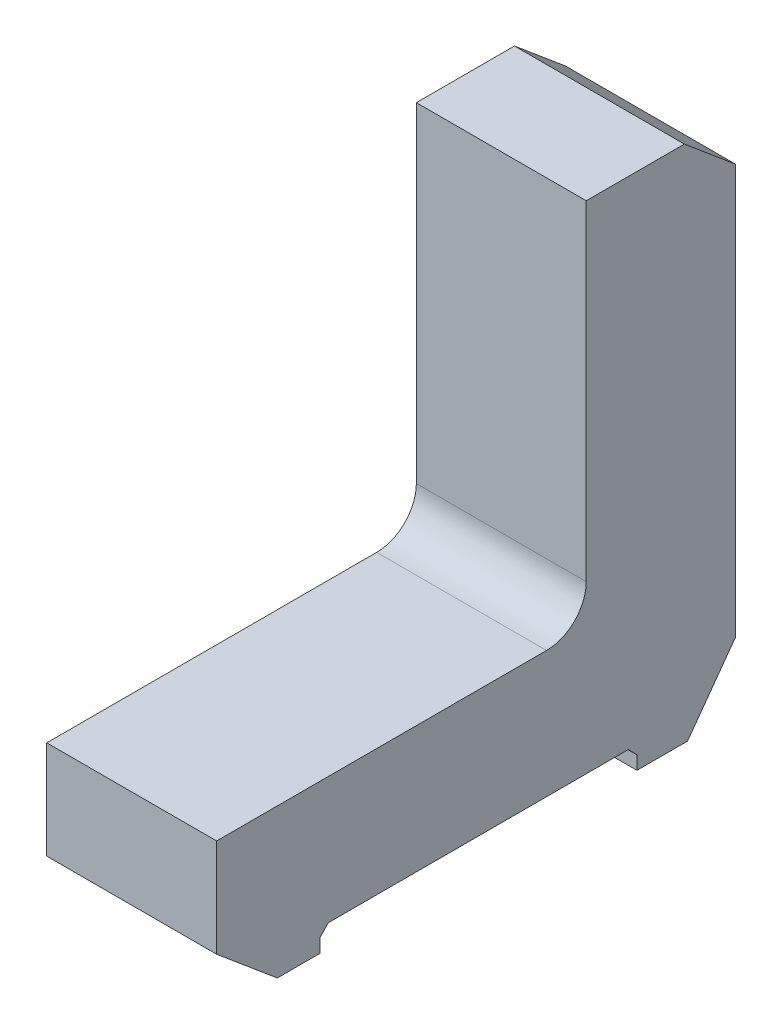
ISO-10303-21;
HEADER;
FILE_DESCRIPTION(('STEP AP214'),'2;1');
FILE_NAME('part.step','',(''),(''),'','','');
FILE_SCHEMA(('AUTOMOTIVE_DESIGN { 1 0 10303 214 1 1 1 1 }'));
ENDSEC;
DATA;
#1=APPLICATION_CONTEXT('core data for automotive mechanical design processes');
#2=APPLICATION_PROTOCOL_DEFINITION('international standard','automotive_design',2000,#1);
#3=PRODUCT_CONTEXT('',#1,'mechanical');
#4=PRODUCT('Part','Part','',(#3));
#5=PRODUCT_RELATED_PRODUCT_CATEGORY('part','',(#4));
#6=PRODUCT_DEFINITION_FORMATION('','',#4);
#7=PRODUCT_DEFINITION_CONTEXT('part definition',#1,'design');
#8=PRODUCT_DEFINITION('design','',#6,#7);
#9=PRODUCT_DEFINITION_SHAPE('','',#8);
#10=(LENGTH_UNIT() NAMED_UNIT(*) SI_UNIT(.MILLI.,.METRE.));
#11=(NAMED_UNIT(*) PLANE_ANGLE_UNIT() SI_UNIT($,.RADIAN.));
#12=(NAMED_UNIT(*) SI_UNIT($,.STERADIAN.) SOLID_ANGLE_UNIT());
#13=UNCERTAINTY_MEASURE_WITH_UNIT(LENGTH_MEASURE(1.E-05),#10,'distance_accuracy_value','');
#14=(GEOMETRIC_REPRESENTATION_CONTEXT(3) GLOBAL_UNCERTAINTY_ASSIGNED_CONTEXT((#13)) GLOBAL_UNIT_ASSIGNED_CONTEXT((#10,
#11,#12)) REPRESENTATION_CONTEXT('',''));
#15=CARTESIAN_POINT('',(0.,0.,0.));
#16=DIRECTION('',(0.,0.,1.));
#17=DIRECTION('',(1.,0.,0.));
#18=AXIS2_PLACEMENT_3D('',#15,#16,#17);
#19=CARTESIAN_POINT('',(57.,-50.,90.3268091391218));
#20=DIRECTION('',(0.,1.,0.));
#21=DIRECTION('',(0.,0.,1.));
#22=AXIS2_PLACEMENT_3D('',#19,#20,#21);
#23=PLANE('',#22);
#24=DIRECTION('',(1.,0.,0.));
#25=VECTOR('',#24,1.);
#26=CARTESIAN_POINT('',(0.,-50.,76.0759070726164));
#27=LINE('',#26,#25);
#28=CARTESIAN_POINT('',(0.,-50.,76.0759070726164));
#29=VERTEX_POINT('',#28);
#30=CARTESIAN_POINT('',(57.,-50.,76.0759070726164));
#31=VERTEX_POINT('',#30);
#32=EDGE_CURVE('E239',#29,#31,#27,.T.);
#33=ORIENTED_EDGE('',*,*,#32,.T.);
#34=DIRECTION('',(0.,0.,-1.));
#35=VECTOR('',#34,1.);
#36=CARTESIAN_POINT('',(57.,-50.,90.3268091391218));
#37=LINE('',#36,#35);
#38=CARTESIAN_POINT('',(57.,-50.,90.3268091391218));
#39=VERTEX_POINT('',#38);
#40=EDGE_CURVE('E104',#39,#31,#37,.T.);
#41=ORIENTED_EDGE('',*,*,#40,.F.);
#42=DIRECTION('',(-1.,0.,0.));
#43=VECTOR('',#42,1.);
#44=CARTESIAN_POINT('',(57.,-50.,90.3268091391218));
#45=LINE('',#44,#43);
#46=CARTESIAN_POINT('',(0.,-50.,90.3268091391218));
#47=VERTEX_POINT('',#46);
#48=EDGE_CURVE('E11',#39,#47,#45,.T.);
#49=ORIENTED_EDGE('',*,*,#48,.T.);
#50=DIRECTION('',(0.,0.,-1.));
#51=VECTOR('',#50,1.);
#52=CARTESIAN_POINT('',(0.,-50.,90.3268091391218));
#53=LINE('',#52,#51);
#54=EDGE_CURVE('E161',#47,#29,#53,.T.);
#55=ORIENTED_EDGE('',*,*,#54,.T.);
#56=EDGE_LOOP('',(#33,#41,#49,#55));
#57=FACE_BOUND('',#56,.T.);
#58=ADVANCED_FACE('F33',(#57),#23,.F.);
#59=CARTESIAN_POINT('',(57.,-32.9212045158419,110.680525014549));
#60=DIRECTION('',(0.,0.766044443118977,-0.64278760968654));
#61=DIRECTION('',(0.,0.64278760968654,0.766044443118977));
#62=AXIS2_PLACEMENT_3D('',#59,#60,#61);
#63=PLANE('',#62);
#64=DIRECTION('',(0.,-0.64278760968654,-0.766044443118977));
#65=VECTOR('',#64,1.);
#66=CARTESIAN_POINT('',(0.,-32.9212045158419,110.680525014549));
#67=LINE('',#66,#65);
#68=CARTESIAN_POINT('',(0.,-32.9212045158419,110.680525014549));
#69=VERTEX_POINT('',#68);
#70=EDGE_CURVE('E156',#69,#47,#67,.T.);
#71=ORIENTED_EDGE('',*,*,#70,.T.);
#72=ORIENTED_EDGE('',*,*,#48,.F.);
#73=DIRECTION('',(0.,-0.64278760968654,-0.766044443118977));
#74=VECTOR('',#73,1.);
#75=CARTESIAN_POINT('',(57.,-32.9212045158419,110.680525014549));
#76=LINE('',#75,#74);
#77=CARTESIAN_POINT('',(57.,-32.9212045158419,110.680525014549));
#78=VERTEX_POINT('',#77);
#79=EDGE_CURVE('E178',#78,#39,#76,.T.);
#80=ORIENTED_EDGE('',*,*,#79,.F.);
#81=DIRECTION('',(-1.,0.,0.));
#82=VECTOR('',#81,1.);
#83=CARTESIAN_POINT('',(57.,-32.9212045158419,110.680525014549));
#84=LINE('',#83,#82);
#85=EDGE_CURVE('E152',#78,#69,#84,.T.);
#86=ORIENTED_EDGE('',*,*,#85,.T.);
#87=EDGE_LOOP('',(#71,#72,#80,#86));
#88=FACE_BOUND('',#87,.T.);
#89=ADVANCED_FACE('F35',(#88),#63,.F.);
#90=CARTESIAN_POINT('',(57.,-50.,-30.3307476927192));
#91=VERTEX_POINT('',#90);
#92=CARTESIAN_POINT('',(57.,-50.,-47.311208731903));
#93=VERTEX_POINT('',#92);
#94=EDGE_CURVE('E229',#91,#93,#37,.T.);
#95=ORIENTED_EDGE('',*,*,#94,.F.);
#96=DIRECTION('',(1.,0.,0.));
#97=VECTOR('',#96,1.);
#98=CARTESIAN_POINT('',(0.,-50.,-30.3307476927192));
#99=LINE('',#98,#97);
#100=CARTESIAN_POINT('',(0.,-50.,-30.3307476927192));
#101=VERTEX_POINT('',#100);
#102=EDGE_CURVE('E241',#101,#91,#99,.T.);
#103=ORIENTED_EDGE('',*,*,#102,.F.);
#104=CARTESIAN_POINT('',(0.,-50.,-47.311208731903));
#105=VERTEX_POINT('',#104);
#106=EDGE_CURVE('E159',#101,#105,#53,.T.);
#107=ORIENTED_EDGE('',*,*,#106,.T.);
#108=DIRECTION('',(-1.,0.,0.));
#109=VECTOR('',#108,1.);
#110=CARTESIAN_POINT('',(57.,-50.,-47.311208731903));
#111=LINE('',#110,#109);
#112=EDGE_CURVE('E41',#93,#105,#111,.T.);
#113=ORIENTED_EDGE('',*,*,#112,.F.);
#114=EDGE_LOOP('',(#95,#103,#107,#113));
#115=FACE_BOUND('',#114,.T.);
#116=ADVANCED_FACE('F321',(#115),#23,.F.);
#117=CARTESIAN_POINT('',(57.,-50.,-47.311208731903));
#118=DIRECTION('',(0.,0.587825711724713,0.80898759733097));
#119=DIRECTION('',(0.,-0.80898759733097,0.587825711724713));
#120=AXIS2_PLACEMENT_3D('',#117,#118,#119);
#121=PLANE('',#120);
#122=DIRECTION('',(0.,0.80898759733097,-0.587825711724713));
#123=VECTOR('',#122,1.);
#124=CARTESIAN_POINT('',(0.,-50.,-47.311208731903));
#125=LINE('',#124,#123);
#126=CARTESIAN_POINT('',(0.,-27.9688288627341,-63.3194749854511));
#127=VERTEX_POINT('',#126);
#128=EDGE_CURVE('E164',#105,#127,#125,.T.);
#129=ORIENTED_EDGE('',*,*,#128,.T.);
#130=DIRECTION('',(-1.,0.,0.));
#131=VECTOR('',#130,1.);
#132=CARTESIAN_POINT('',(57.,-27.9688288627341,-63.3194749854511));
#133=LINE('',#132,#131);
#134=CARTESIAN_POINT('',(57.,-27.9688288627341,-63.3194749854511));
#135=VERTEX_POINT('',#134);
#136=EDGE_CURVE('E191',#135,#127,#133,.T.);
#137=ORIENTED_EDGE('',*,*,#136,.F.);
#138=DIRECTION('',(0.,0.80898759733097,-0.587825711724713));
#139=VECTOR('',#138,1.);
#140=CARTESIAN_POINT('',(57.,-50.,-47.311208731903));
#141=LINE('',#140,#139);
#142=EDGE_CURVE('E200',#93,#135,#141,.T.);
#143=ORIENTED_EDGE('',*,*,#142,.F.);
#144=ORIENTED_EDGE('',*,*,#112,.T.);
#145=EDGE_LOOP('',(#129,#137,#143,#144));
#146=FACE_BOUND('',#145,.T.);
#147=ADVANCED_FACE('F198',(#146),#121,.F.);
#148=CARTESIAN_POINT('',(57.,109.669189008291,-63.3194749854511));
#149=DIRECTION('',(0.,0.,1.));
#150=DIRECTION('',(1.,0.,0.));
#151=AXIS2_PLACEMENT_3D('',#148,#149,#150);
#152=PLANE('',#151);
#153=DIRECTION('',(0.,1.,0.));
#154=VECTOR('',#153,1.);
#155=CARTESIAN_POINT('',(0.,109.669189008291,-63.3194749854511));
#156=LINE('',#155,#154);
#157=CARTESIAN_POINT('',(0.,109.669189008291,-63.3194749854511));
#158=VERTEX_POINT('',#157);
#159=EDGE_CURVE('E166',#127,#158,#156,.T.);
#160=ORIENTED_EDGE('',*,*,#159,.T.);
#161=DIRECTION('',(-1.,0.,0.));
#162=VECTOR('',#161,1.);
#163=CARTESIAN_POINT('',(57.,109.669189008291,-63.3194749854511));
#164=LINE('',#163,#162);
#165=CARTESIAN_POINT('',(57.,109.669189008291,-63.3194749854511));
#166=VERTEX_POINT('',#165);
#167=EDGE_CURVE('E188',#166,#158,#164,.T.);
#168=ORIENTED_EDGE('',*,*,#167,.F.);
#169=DIRECTION('',(0.,1.,0.));
#170=VECTOR('',#169,1.);
#171=CARTESIAN_POINT('',(57.,109.669189008291,-63.3194749854511));
#172=LINE('',#171,#170);
#173=EDGE_CURVE('E222',#135,#166,#172,.T.);
#174=ORIENTED_EDGE('',*,*,#173,.F.);
#175=ORIENTED_EDGE('',*,*,#136,.T.);
#176=EDGE_LOOP('',(#160,#168,#174,#175));
#177=FACE_BOUND('',#176,.T.);
#178=ADVANCED_FACE('F213',(#177),#152,.F.);
#179=CARTESIAN_POINT('',(57.,124.,-46.2406795012929));
#180=DIRECTION('',(0.,-0.766044443118977,0.642787609686541));
#181=DIRECTION('',(0.,-0.642787609686541,-0.766044443118977));
#182=AXIS2_PLACEMENT_3D('',#179,#180,#181);
#183=PLANE('',#182);
#184=DIRECTION('',(0.,0.642787609686541,0.766044443118977));
#185=VECTOR('',#184,1.);
#186=CARTESIAN_POINT('',(0.,124.,-46.2406795012929));
#187=LINE('',#186,#185);
#188=CARTESIAN_POINT('',(0.,124.,-46.2406795012929));
#189=VERTEX_POINT('',#188);
#190=EDGE_CURVE('E168',#158,#189,#187,.T.);
#191=ORIENTED_EDGE('',*,*,#190,.T.);
#192=DIRECTION('',(-1.,0.,0.));
#193=VECTOR('',#192,1.);
#194=CARTESIAN_POINT('',(57.,124.,-46.2406795012929));
#195=LINE('',#194,#193);
#196=CARTESIAN_POINT('',(57.,124.,-46.2406795012929));
#197=VERTEX_POINT('',#196);
#198=EDGE_CURVE('E185',#197,#189,#195,.T.);
#199=ORIENTED_EDGE('',*,*,#198,.F.);
#200=DIRECTION('',(0.,0.642787609686541,0.766044443118977));
#201=VECTOR('',#200,1.);
#202=CARTESIAN_POINT('',(57.,124.,-46.2406795012929));
#203=LINE('',#202,#201);
#204=EDGE_CURVE('E219',#166,#197,#203,.T.);
#205=ORIENTED_EDGE('',*,*,#204,.F.);
#206=ORIENTED_EDGE('',*,*,#167,.T.);
#207=EDGE_LOOP('',(#191,#199,#205,#206));
#208=FACE_BOUND('',#207,.T.);
#209=ADVANCED_FACE('F217',(#208),#183,.F.);
#210=CARTESIAN_POINT('',(57.,124.,-13.3194749854511));
#211=DIRECTION('',(0.,-1.,0.));
#212=DIRECTION('',(0.,0.,-1.));
#213=AXIS2_PLACEMENT_3D('',#210,#211,#212);
#214=PLANE('',#213);
#215=DIRECTION('',(0.,0.,1.));
#216=VECTOR('',#215,1.);
#217=CARTESIAN_POINT('',(0.,124.,-13.3194749854511));
#218=LINE('',#217,#216);
#219=CARTESIAN_POINT('',(0.,124.,-13.3194749854511));
#220=VERTEX_POINT('',#219);
#221=EDGE_CURVE('E170',#189,#220,#218,.T.);
#222=ORIENTED_EDGE('',*,*,#221,.T.);
#223=DIRECTION('',(-1.,0.,0.));
#224=VECTOR('',#223,1.);
#225=CARTESIAN_POINT('',(57.,124.,-13.3194749854511));
#226=LINE('',#225,#224);
#227=CARTESIAN_POINT('',(57.,124.,-13.3194749854511));
#228=VERTEX_POINT('',#227);
#229=EDGE_CURVE('E182',#228,#220,#226,.T.);
#230=ORIENTED_EDGE('',*,*,#229,.F.);
#231=DIRECTION('',(0.,0.,1.));
#232=VECTOR('',#231,1.);
#233=CARTESIAN_POINT('',(57.,124.,-13.3194749854511));
#234=LINE('',#233,#232);
#235=EDGE_CURVE('E221',#197,#228,#234,.T.);
#236=ORIENTED_EDGE('',*,*,#235,.F.);
#237=ORIENTED_EDGE('',*,*,#198,.T.);
#238=EDGE_LOOP('',(#222,#230,#236,#237));
#239=FACE_BOUND('',#238,.T.);
#240=ADVANCED_FACE('F338',(#239),#214,.F.);
#241=CARTESIAN_POINT('',(57.,13.3194749854511,-13.3194749854511));
#242=DIRECTION('',(0.,0.,-1.));
#243=DIRECTION('',(-1.,0.,0.));
#244=AXIS2_PLACEMENT_3D('',#241,#242,#243);
#245=PLANE('',#244);
#246=DIRECTION('',(0.,-1.,0.));
#247=VECTOR('',#246,1.);
#248=CARTESIAN_POINT('',(0.,13.3194749854511,-13.3194749854511));
#249=LINE('',#248,#247);
#250=CARTESIAN_POINT('',(0.,13.3194749854511,-13.3194749854511));
#251=VERTEX_POINT('',#250);
#252=EDGE_CURVE('E172',#220,#251,#249,.T.);
#253=ORIENTED_EDGE('',*,*,#252,.T.);
#254=DIRECTION('',(-1.,0.,0.));
#255=VECTOR('',#254,1.);
#256=CARTESIAN_POINT('',(57.,13.3194749854511,-13.3194749854511));
#257=LINE('',#256,#255);
#258=CARTESIAN_POINT('',(57.,13.3194749854511,-13.3194749854511));
#259=VERTEX_POINT('',#258);
#260=EDGE_CURVE('E147',#259,#251,#257,.T.);
#261=ORIENTED_EDGE('',*,*,#260,.F.);
#262=DIRECTION('',(0.,-1.,0.));
#263=VECTOR('',#262,1.);
#264=CARTESIAN_POINT('',(57.,13.3194749854511,-13.3194749854511));
#265=LINE('',#264,#263);
#266=EDGE_CURVE('E135',#228,#259,#265,.T.);
#267=ORIENTED_EDGE('',*,*,#266,.F.);
#268=ORIENTED_EDGE('',*,*,#229,.T.);
#269=EDGE_LOOP('',(#253,#261,#267,#268));
#270=FACE_BOUND('',#269,.T.);
#271=ADVANCED_FACE('F341',(#270),#245,.F.);
#272=CARTESIAN_POINT('',(57.,13.3194749854511,0.));
#273=DIRECTION('',(-1.,0.,0.));
#274=DIRECTION('',(0.,0.,1.));
#275=AXIS2_PLACEMENT_3D('',#272,#273,#274);
#276=CYLINDRICAL_SURFACE('',#275,13.3194749854511);
#277=CARTESIAN_POINT('',(0.,13.3194749854511,0.));
#278=DIRECTION('',(-1.,0.,0.));
#279=DIRECTION('',(0.,0.,-1.));
#280=AXIS2_PLACEMENT_3D('',#277,#278,#279);
#281=CIRCLE('',#280,13.3194749854511);
#282=CARTESIAN_POINT('',(0.,0.,0.));
#283=VERTEX_POINT('',#282);
#284=EDGE_CURVE('E144',#251,#283,#281,.T.);
#285=ORIENTED_EDGE('',*,*,#284,.T.);
#286=DIRECTION('',(-1.,0.,0.));
#287=VECTOR('',#286,1.);
#288=CARTESIAN_POINT('',(57.,0.,0.));
#289=LINE('',#288,#287);
#290=CARTESIAN_POINT('',(57.,0.,0.));
#291=VERTEX_POINT('',#290);
#292=EDGE_CURVE('E141',#291,#283,#289,.T.);
#293=ORIENTED_EDGE('',*,*,#292,.F.);
#294=CARTESIAN_POINT('',(57.,13.3194749854511,0.));
#295=DIRECTION('',(-1.,0.,0.));
#296=DIRECTION('',(0.,0.,-1.));
#297=AXIS2_PLACEMENT_3D('',#294,#295,#296);
#298=CIRCLE('',#297,13.3194749854511);
#299=EDGE_CURVE('E127',#259,#291,#298,.T.);
#300=ORIENTED_EDGE('',*,*,#299,.F.);
#301=ORIENTED_EDGE('',*,*,#260,.T.);
#302=EDGE_LOOP('',(#285,#293,#300,#301));
#303=FACE_BOUND('',#302,.T.);
#304=ADVANCED_FACE('F142',(#303),#276,.F.);
#305=CARTESIAN_POINT('',(57.,0.,110.680525014549));
#306=DIRECTION('',(0.,-1.,0.));
#307=DIRECTION('',(0.,0.,-1.));
#308=AXIS2_PLACEMENT_3D('',#305,#306,#307);
#309=PLANE('',#308);
#310=DIRECTION('',(0.,0.,1.));
#311=VECTOR('',#310,1.);
#312=CARTESIAN_POINT('',(0.,0.,110.680525014549));
#313=LINE('',#312,#311);
#314=CARTESIAN_POINT('',(0.,0.,110.680525014549));
#315=VERTEX_POINT('',#314);
#316=EDGE_CURVE('E175',#283,#315,#313,.T.);
#317=ORIENTED_EDGE('',*,*,#316,.T.);
#318=DIRECTION('',(-1.,0.,0.));
#319=VECTOR('',#318,1.);
#320=CARTESIAN_POINT('',(57.,0.,110.680525014549));
#321=LINE('',#320,#319);
#322=CARTESIAN_POINT('',(57.,0.,110.680525014549));
#323=VERTEX_POINT('',#322);
#324=EDGE_CURVE('E148',#323,#315,#321,.T.);
#325=ORIENTED_EDGE('',*,*,#324,.F.);
#326=DIRECTION('',(0.,0.,1.));
#327=VECTOR('',#326,1.);
#328=CARTESIAN_POINT('',(57.,0.,110.680525014549));
#329=LINE('',#328,#327);
#330=EDGE_CURVE('E132',#291,#323,#329,.T.);
#331=ORIENTED_EDGE('',*,*,#330,.F.);
#332=ORIENTED_EDGE('',*,*,#292,.T.);
#333=EDGE_LOOP('',(#317,#325,#331,#332));
#334=FACE_BOUND('',#333,.T.);
#335=ADVANCED_FACE('F150',(#334),#309,.F.);
#336=CARTESIAN_POINT('',(57.,0.,110.680525014549));
#337=DIRECTION('',(0.,0.,-1.));
#338=DIRECTION('',(0.,1.,0.));
#339=AXIS2_PLACEMENT_3D('',#336,#337,#338);
#340=PLANE('',#339);
#341=DIRECTION('',(0.,-1.,0.));
#342=VECTOR('',#341,1.);
#343=CARTESIAN_POINT('',(0.,0.,110.680525014549));
#344=LINE('',#343,#342);
#345=EDGE_CURVE('E96',#315,#69,#344,.T.);
#346=ORIENTED_EDGE('',*,*,#345,.T.);
#347=ORIENTED_EDGE('',*,*,#85,.F.);
#348=DIRECTION('',(0.,-1.,0.));
#349=VECTOR('',#348,1.);
#350=CARTESIAN_POINT('',(57.,0.,110.680525014549));
#351=LINE('',#350,#349);
#352=EDGE_CURVE('E57',#323,#78,#351,.T.);
#353=ORIENTED_EDGE('',*,*,#352,.F.);
#354=ORIENTED_EDGE('',*,*,#324,.T.);
#355=EDGE_LOOP('',(#346,#347,#353,#354));
#356=FACE_BOUND('',#355,.T.);
#357=ADVANCED_FACE('F350',(#356),#340,.F.);
#358=CARTESIAN_POINT('',(57.,13.3194749854511,0.));
#359=DIRECTION('',(1.,0.,0.));
#360=DIRECTION('',(0.,0.,-1.));
#361=AXIS2_PLACEMENT_3D('',#358,#359,#360);
#362=PLANE('',#361);
#363=DIRECTION('',(0.,1.,0.));
#364=VECTOR('',#363,1.);
#365=CARTESIAN_POINT('',(57.,0.,-30.3307476927192));
#366=LINE('',#365,#364);
#367=CARTESIAN_POINT('',(57.,-45.5,-30.3307476927192));
#368=VERTEX_POINT('',#367);
#369=EDGE_CURVE('E246',#91,#368,#366,.T.);
#370=ORIENTED_EDGE('',*,*,#369,.F.);
#371=ORIENTED_EDGE('',*,*,#94,.T.);
#372=ORIENTED_EDGE('',*,*,#142,.T.);
#373=ORIENTED_EDGE('',*,*,#173,.T.);
#374=ORIENTED_EDGE('',*,*,#204,.T.);
#375=ORIENTED_EDGE('',*,*,#235,.T.);
#376=ORIENTED_EDGE('',*,*,#266,.T.);
#377=ORIENTED_EDGE('',*,*,#299,.T.);
#378=ORIENTED_EDGE('',*,*,#330,.T.);
#379=ORIENTED_EDGE('',*,*,#352,.T.);
#380=ORIENTED_EDGE('',*,*,#79,.T.);
#381=ORIENTED_EDGE('',*,*,#40,.T.);
#382=DIRECTION('',(0.,1.,0.));
#383=VECTOR('',#382,1.);
#384=CARTESIAN_POINT('',(57.,-2.34614510142396E-13,76.0759070726165));
#385=LINE('',#384,#383);
#386=CARTESIAN_POINT('',(57.,-45.5,76.0759070726164));
#387=VERTEX_POINT('',#386);
#388=EDGE_CURVE('E250',#31,#387,#385,.T.);
#389=ORIENTED_EDGE('',*,*,#388,.T.);
#390=DIRECTION('',(0.,0.722659500474169,-0.691204200200219));
#391=VECTOR('',#390,1.);
#392=CARTESIAN_POINT('',(57.,16.2620897088976,17.0021444057977));
#393=LINE('',#392,#391);
#394=CARTESIAN_POINT('',(57.,-42.5,73.2064884885666));
#395=VERTEX_POINT('',#394);
#396=EDGE_CURVE('E253',#387,#395,#393,.T.);
#397=ORIENTED_EDGE('',*,*,#396,.T.);
#398=DIRECTION('',(0.,0.,-1.));
#399=VECTOR('',#398,1.);
#400=CARTESIAN_POINT('',(57.,-42.5,0.));
#401=LINE('',#400,#399);
#402=CARTESIAN_POINT('',(57.,-42.5,-27.4613291086695));
#403=VERTEX_POINT('',#402);
#404=EDGE_CURVE('E256',#395,#403,#401,.T.);
#405=ORIENTED_EDGE('',*,*,#404,.T.);
#406=DIRECTION('',(0.,-0.722659500474165,-0.691204200200223));
#407=VECTOR('',#406,1.);
#408=CARTESIAN_POINT('',(57.,-6.58785902922985,6.88765912284445));
#409=LINE('',#408,#407);
#410=EDGE_CURVE('E259',#403,#368,#409,.T.);
#411=ORIENTED_EDGE('',*,*,#410,.T.);
#412=EDGE_LOOP('',(#370,#371,#372,#373,#374,#375,#376,#377,#378,#379,#380,#381,#389,#397,#405,#411));
#413=FACE_BOUND('',#412,.T.);
#414=ADVANCED_FACE('F130',(#413),#362,.T.);
#415=CARTESIAN_POINT('',(0.,13.3194749854511,0.));
#416=DIRECTION('',(1.,0.,0.));
#417=DIRECTION('',(0.,0.,-1.));
#418=AXIS2_PLACEMENT_3D('',#415,#416,#417);
#419=PLANE('',#418);
#420=ORIENTED_EDGE('',*,*,#106,.F.);
#421=DIRECTION('',(0.,1.,0.));
#422=VECTOR('',#421,1.);
#423=CARTESIAN_POINT('',(0.,0.,-30.3307476927192));
#424=LINE('',#423,#422);
#425=CARTESIAN_POINT('',(0.,-45.5,-30.3307476927192));
#426=VERTEX_POINT('',#425);
#427=EDGE_CURVE('E234',#101,#426,#424,.T.);
#428=ORIENTED_EDGE('',*,*,#427,.T.);
#429=DIRECTION('',(0.,-0.722659500474165,-0.691204200200223));
#430=VECTOR('',#429,1.);
#431=CARTESIAN_POINT('',(0.,-6.58785902922985,6.88765912284445));
#432=LINE('',#431,#430);
#433=CARTESIAN_POINT('',(0.,-42.5,-27.4613291086695));
#434=VERTEX_POINT('',#433);
#435=EDGE_CURVE('E249',#434,#426,#432,.T.);
#436=ORIENTED_EDGE('',*,*,#435,.F.);
#437=DIRECTION('',(0.,0.,-1.));
#438=VECTOR('',#437,1.);
#439=CARTESIAN_POINT('',(0.,-42.5,0.));
#440=LINE('',#439,#438);
#441=CARTESIAN_POINT('',(0.,-42.5,73.2064884885666));
#442=VERTEX_POINT('',#441);
#443=EDGE_CURVE('E268',#442,#434,#440,.T.);
#444=ORIENTED_EDGE('',*,*,#443,.F.);
#445=DIRECTION('',(0.,0.722659500474169,-0.691204200200219));
#446=VECTOR('',#445,1.);
#447=CARTESIAN_POINT('',(0.,16.2620897088976,17.0021444057977));
#448=LINE('',#447,#446);
#449=CARTESIAN_POINT('',(0.,-45.5,76.0759070726164));
#450=VERTEX_POINT('',#449);
#451=EDGE_CURVE('E266',#450,#442,#448,.T.);
#452=ORIENTED_EDGE('',*,*,#451,.F.);
#453=DIRECTION('',(0.,1.,0.));
#454=VECTOR('',#453,1.);
#455=CARTESIAN_POINT('',(0.,-2.34614510142396E-13,76.0759070726165));
#456=LINE('',#455,#454);
#457=EDGE_CURVE('E263',#29,#450,#456,.T.);
#458=ORIENTED_EDGE('',*,*,#457,.F.);
#459=ORIENTED_EDGE('',*,*,#54,.F.);
#460=ORIENTED_EDGE('',*,*,#70,.F.);
#461=ORIENTED_EDGE('',*,*,#345,.F.);
#462=ORIENTED_EDGE('',*,*,#316,.F.);
#463=ORIENTED_EDGE('',*,*,#284,.F.);
#464=ORIENTED_EDGE('',*,*,#252,.F.);
#465=ORIENTED_EDGE('',*,*,#221,.F.);
#466=ORIENTED_EDGE('',*,*,#190,.F.);
#467=ORIENTED_EDGE('',*,*,#159,.F.);
#468=ORIENTED_EDGE('',*,*,#128,.F.);
#469=EDGE_LOOP('',(#420,#428,#436,#444,#452,#458,#459,#460,#461,#462,#463,#464,#465,#466,#467,#468));
#470=FACE_BOUND('',#469,.T.);
#471=ADVANCED_FACE('F206',(#470),#419,.F.);
#472=CARTESIAN_POINT('',(0.,-6.58785902922985,6.88765912284445));
#473=DIRECTION('',(0.,-0.691204200200223,0.722659500474165));
#474=DIRECTION('',(0.,-0.722659500474165,-0.691204200200223));
#475=AXIS2_PLACEMENT_3D('',#472,#473,#474);
#476=PLANE('',#475);
#477=ORIENTED_EDGE('',*,*,#410,.F.);
#478=DIRECTION('',(1.,0.,0.));
#479=VECTOR('',#478,1.);
#480=CARTESIAN_POINT('',(0.,-42.5,-27.4613291086695));
#481=LINE('',#480,#479);
#482=EDGE_CURVE('E231',#434,#403,#481,.T.);
#483=ORIENTED_EDGE('',*,*,#482,.F.);
#484=ORIENTED_EDGE('',*,*,#435,.T.);
#485=DIRECTION('',(1.,0.,0.));
#486=VECTOR('',#485,1.);
#487=CARTESIAN_POINT('',(0.,-45.5,-30.3307476927192));
#488=LINE('',#487,#486);
#489=EDGE_CURVE('E160',#426,#368,#488,.T.);
#490=ORIENTED_EDGE('',*,*,#489,.T.);
#491=EDGE_LOOP('',(#477,#483,#484,#490));
#492=FACE_BOUND('',#491,.T.);
#493=ADVANCED_FACE('F276',(#492),#476,.T.);
#494=CARTESIAN_POINT('',(0.,0.,-30.3307476927192));
#495=DIRECTION('',(0.,0.,-1.));
#496=DIRECTION('',(-1.,0.,0.));
#497=AXIS2_PLACEMENT_3D('',#494,#495,#496);
#498=PLANE('',#497);
#499=ORIENTED_EDGE('',*,*,#369,.T.);
#500=ORIENTED_EDGE('',*,*,#489,.F.);
#501=ORIENTED_EDGE('',*,*,#427,.F.);
#502=ORIENTED_EDGE('',*,*,#102,.T.);
#503=EDGE_LOOP('',(#499,#500,#501,#502));
#504=FACE_BOUND('',#503,.T.);
#505=ADVANCED_FACE('F282',(#504),#498,.F.);
#506=CARTESIAN_POINT('',(0.,-2.34614510142396E-13,76.0759070726165));
#507=DIRECTION('',(0.,0.,-1.));
#508=DIRECTION('',(0.,1.,0.));
#509=AXIS2_PLACEMENT_3D('',#506,#507,#508);
#510=PLANE('',#509);
#511=ORIENTED_EDGE('',*,*,#388,.F.);
#512=ORIENTED_EDGE('',*,*,#32,.F.);
#513=ORIENTED_EDGE('',*,*,#457,.T.);
#514=DIRECTION('',(1.,0.,0.));
#515=VECTOR('',#514,1.);
#516=CARTESIAN_POINT('',(0.,-45.5,76.0759070726164));
#517=LINE('',#516,#515);
#518=EDGE_CURVE('E236',#450,#387,#517,.T.);
#519=ORIENTED_EDGE('',*,*,#518,.T.);
#520=EDGE_LOOP('',(#511,#512,#513,#519));
#521=FACE_BOUND('',#520,.T.);
#522=ADVANCED_FACE('F297',(#521),#510,.T.);
#523=CARTESIAN_POINT('',(0.,16.2620897088976,17.0021444057977));
#524=DIRECTION('',(0.,-0.691204200200219,-0.722659500474169));
#525=DIRECTION('',(0.,0.722659500474169,-0.691204200200219));
#526=AXIS2_PLACEMENT_3D('',#523,#524,#525);
#527=PLANE('',#526);
#528=ORIENTED_EDGE('',*,*,#396,.F.);
#529=ORIENTED_EDGE('',*,*,#518,.F.);
#530=ORIENTED_EDGE('',*,*,#451,.T.);
#531=DIRECTION('',(1.,0.,0.));
#532=VECTOR('',#531,1.);
#533=CARTESIAN_POINT('',(0.,-42.5,73.2064884885666));
#534=LINE('',#533,#532);
#535=EDGE_CURVE('E48',#442,#395,#534,.T.);
#536=ORIENTED_EDGE('',*,*,#535,.T.);
#537=EDGE_LOOP('',(#528,#529,#530,#536));
#538=FACE_BOUND('',#537,.T.);
#539=ADVANCED_FACE('F311',(#538),#527,.T.);
#540=CARTESIAN_POINT('',(0.,-42.5,0.));
#541=DIRECTION('',(0.,-1.,0.));
#542=DIRECTION('',(0.,0.,-1.));
#543=AXIS2_PLACEMENT_3D('',#540,#541,#542);
#544=PLANE('',#543);
#545=ORIENTED_EDGE('',*,*,#404,.F.);
#546=ORIENTED_EDGE('',*,*,#535,.F.);
#547=ORIENTED_EDGE('',*,*,#443,.T.);
#548=ORIENTED_EDGE('',*,*,#482,.T.);
#549=EDGE_LOOP('',(#545,#546,#547,#548));
#550=FACE_BOUND('',#549,.T.);
#551=ADVANCED_FACE('F312',(#550),#544,.T.);
#552=CLOSED_SHELL('',(#58,#89,#116,#147,#178,#209,#240,#271,#304,#335,#357,#414,#471,#493,#505,
#522,#539,#551));
#553=MANIFOLD_SOLID_BREP('B2',#552);
#554=ADVANCED_BREP_SHAPE_REPRESENTATION('',(#18,#553),#14);
#555=SHAPE_DEFINITION_REPRESENTATION(#9,#554);
ENDSEC;
END-ISO-10303-21;
